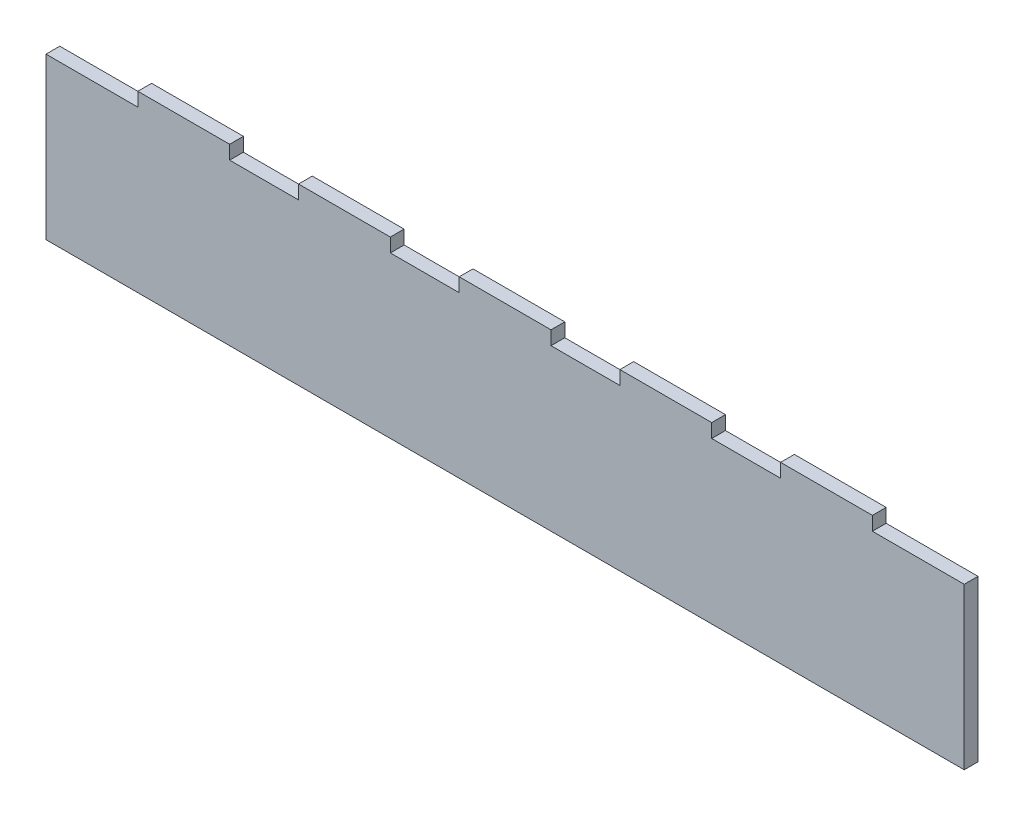
ISO-10303-21;
HEADER;
FILE_DESCRIPTION(('STEP AP214'),'2;1');
FILE_NAME('part.step','',(''),(''),'','','');
FILE_SCHEMA(('AUTOMOTIVE_DESIGN { 1 0 10303 214 1 1 1 1 }'));
ENDSEC;
DATA;
#1=APPLICATION_CONTEXT('core data for automotive mechanical design processes');
#2=APPLICATION_PROTOCOL_DEFINITION('international standard','automotive_design',2000,#1);
#3=PRODUCT_CONTEXT('',#1,'mechanical');
#4=PRODUCT('Part','Part','',(#3));
#5=PRODUCT_RELATED_PRODUCT_CATEGORY('part','',(#4));
#6=PRODUCT_DEFINITION_FORMATION('','',#4);
#7=PRODUCT_DEFINITION_CONTEXT('part definition',#1,'design');
#8=PRODUCT_DEFINITION('design','',#6,#7);
#9=PRODUCT_DEFINITION_SHAPE('','',#8);
#10=(LENGTH_UNIT() NAMED_UNIT(*) SI_UNIT(.MILLI.,.METRE.));
#11=(NAMED_UNIT(*) PLANE_ANGLE_UNIT() SI_UNIT($,.RADIAN.));
#12=(NAMED_UNIT(*) SI_UNIT($,.STERADIAN.) SOLID_ANGLE_UNIT());
#13=UNCERTAINTY_MEASURE_WITH_UNIT(LENGTH_MEASURE(1.E-05),#10,'distance_accuracy_value','');
#14=(GEOMETRIC_REPRESENTATION_CONTEXT(3) GLOBAL_UNCERTAINTY_ASSIGNED_CONTEXT((#13)) GLOBAL_UNIT_ASSIGNED_CONTEXT((#10,
#11,#12)) REPRESENTATION_CONTEXT('',''));
#15=CARTESIAN_POINT('',(0.,0.,0.));
#16=DIRECTION('',(0.,0.,1.));
#17=DIRECTION('',(1.,0.,0.));
#18=AXIS2_PLACEMENT_3D('',#15,#16,#17);
#19=CARTESIAN_POINT('',(0.,0.,-3.));
#20=DIRECTION('',(-1.,0.,0.));
#21=DIRECTION('',(0.,0.,1.));
#22=AXIS2_PLACEMENT_3D('',#19,#20,#21);
#23=PLANE('',#22);
#24=DIRECTION('',(0.,-1.,0.));
#25=VECTOR('',#24,1.);
#26=CARTESIAN_POINT('',(0.,0.,0.));
#27=LINE('',#26,#25);
#28=CARTESIAN_POINT('',(0.,0.,0.));
#29=VERTEX_POINT('',#28);
#30=CARTESIAN_POINT('',(0.,-35.,0.));
#31=VERTEX_POINT('',#30);
#32=EDGE_CURVE('E230',#29,#31,#27,.T.);
#33=ORIENTED_EDGE('',*,*,#32,.F.);
#34=DIRECTION('',(0.,0.,1.));
#35=VECTOR('',#34,1.);
#36=CARTESIAN_POINT('',(0.,0.,-3.));
#37=LINE('',#36,#35);
#38=CARTESIAN_POINT('',(0.,0.,-3.));
#39=VERTEX_POINT('',#38);
#40=EDGE_CURVE('E11',#39,#29,#37,.T.);
#41=ORIENTED_EDGE('',*,*,#40,.F.);
#42=DIRECTION('',(0.,-1.,0.));
#43=VECTOR('',#42,1.);
#44=CARTESIAN_POINT('',(0.,0.,-3.));
#45=LINE('',#44,#43);
#46=CARTESIAN_POINT('',(0.,-35.,-3.));
#47=VERTEX_POINT('',#46);
#48=EDGE_CURVE('E287',#39,#47,#45,.T.);
#49=ORIENTED_EDGE('',*,*,#48,.T.);
#50=DIRECTION('',(0.,0.,1.));
#51=VECTOR('',#50,1.);
#52=CARTESIAN_POINT('',(0.,-35.,-3.));
#53=LINE('',#52,#51);
#54=EDGE_CURVE('E38',#47,#31,#53,.T.);
#55=ORIENTED_EDGE('',*,*,#54,.T.);
#56=EDGE_LOOP('',(#33,#41,#49,#55));
#57=FACE_BOUND('',#56,.T.);
#58=ADVANCED_FACE('F35',(#57),#23,.T.);
#59=CARTESIAN_POINT('',(0.,0.,-3.));
#60=DIRECTION('',(0.,-1.,0.));
#61=DIRECTION('',(0.,0.,-1.));
#62=AXIS2_PLACEMENT_3D('',#59,#60,#61);
#63=PLANE('',#62);
#64=DIRECTION('',(1.,0.,0.));
#65=VECTOR('',#64,1.);
#66=CARTESIAN_POINT('',(0.,0.,0.));
#67=LINE('',#66,#65);
#68=CARTESIAN_POINT('',(20.,0.,0.));
#69=VERTEX_POINT('',#68);
#70=EDGE_CURVE('E128',#29,#69,#67,.T.);
#71=ORIENTED_EDGE('',*,*,#70,.T.);
#72=DIRECTION('',(0.,0.,1.));
#73=VECTOR('',#72,1.);
#74=CARTESIAN_POINT('',(20.,0.,-3.));
#75=LINE('',#74,#73);
#76=CARTESIAN_POINT('',(20.,0.,-3.));
#77=VERTEX_POINT('',#76);
#78=EDGE_CURVE('E44',#77,#69,#75,.T.);
#79=ORIENTED_EDGE('',*,*,#78,.F.);
#80=DIRECTION('',(1.,0.,0.));
#81=VECTOR('',#80,1.);
#82=CARTESIAN_POINT('',(0.,0.,-3.));
#83=LINE('',#82,#81);
#84=EDGE_CURVE('E208',#39,#77,#83,.T.);
#85=ORIENTED_EDGE('',*,*,#84,.F.);
#86=ORIENTED_EDGE('',*,*,#40,.T.);
#87=EDGE_LOOP('',(#71,#79,#85,#86));
#88=FACE_BOUND('',#87,.T.);
#89=ADVANCED_FACE('F477',(#88),#63,.F.);
#90=CARTESIAN_POINT('',(20.,0.,-3.));
#91=DIRECTION('',(1.,0.,0.));
#92=DIRECTION('',(0.,0.,-1.));
#93=AXIS2_PLACEMENT_3D('',#90,#91,#92);
#94=PLANE('',#93);
#95=DIRECTION('',(0.,1.,0.));
#96=VECTOR('',#95,1.);
#97=CARTESIAN_POINT('',(20.,0.,0.));
#98=LINE('',#97,#96);
#99=CARTESIAN_POINT('',(20.,3.,0.));
#100=VERTEX_POINT('',#99);
#101=EDGE_CURVE('E215',#69,#100,#98,.T.);
#102=ORIENTED_EDGE('',*,*,#101,.T.);
#103=DIRECTION('',(0.,0.,1.));
#104=VECTOR('',#103,1.);
#105=CARTESIAN_POINT('',(20.,3.,-3.));
#106=LINE('',#105,#104);
#107=CARTESIAN_POINT('',(20.,3.,-3.));
#108=VERTEX_POINT('',#107);
#109=EDGE_CURVE('E212',#108,#100,#106,.T.);
#110=ORIENTED_EDGE('',*,*,#109,.F.);
#111=DIRECTION('',(0.,1.,0.));
#112=VECTOR('',#111,1.);
#113=CARTESIAN_POINT('',(20.,0.,-3.));
#114=LINE('',#113,#112);
#115=EDGE_CURVE('E200',#77,#108,#114,.T.);
#116=ORIENTED_EDGE('',*,*,#115,.F.);
#117=ORIENTED_EDGE('',*,*,#78,.T.);
#118=EDGE_LOOP('',(#102,#110,#116,#117));
#119=FACE_BOUND('',#118,.T.);
#120=ADVANCED_FACE('F213',(#119),#94,.F.);
#121=CARTESIAN_POINT('',(20.,3.,-3.));
#122=DIRECTION('',(0.,-1.,0.));
#123=DIRECTION('',(0.,0.,-1.));
#124=AXIS2_PLACEMENT_3D('',#121,#122,#123);
#125=PLANE('',#124);
#126=DIRECTION('',(1.,0.,0.));
#127=VECTOR('',#126,1.);
#128=CARTESIAN_POINT('',(20.,3.,0.));
#129=LINE('',#128,#127);
#130=CARTESIAN_POINT('',(40.,3.,0.));
#131=VERTEX_POINT('',#130);
#132=EDGE_CURVE('E284',#100,#131,#129,.T.);
#133=ORIENTED_EDGE('',*,*,#132,.T.);
#134=DIRECTION('',(0.,0.,1.));
#135=VECTOR('',#134,1.);
#136=CARTESIAN_POINT('',(40.,3.,-3.));
#137=LINE('',#136,#135);
#138=CARTESIAN_POINT('',(40.,3.,-3.));
#139=VERTEX_POINT('',#138);
#140=EDGE_CURVE('E219',#139,#131,#137,.T.);
#141=ORIENTED_EDGE('',*,*,#140,.F.);
#142=DIRECTION('',(1.,0.,0.));
#143=VECTOR('',#142,1.);
#144=CARTESIAN_POINT('',(20.,3.,-3.));
#145=LINE('',#144,#143);
#146=EDGE_CURVE('E206',#108,#139,#145,.T.);
#147=ORIENTED_EDGE('',*,*,#146,.F.);
#148=ORIENTED_EDGE('',*,*,#109,.T.);
#149=EDGE_LOOP('',(#133,#141,#147,#148));
#150=FACE_BOUND('',#149,.T.);
#151=ADVANCED_FACE('F221',(#150),#125,.F.);
#152=CARTESIAN_POINT('',(40.,0.,-3.));
#153=DIRECTION('',(1.,0.,0.));
#154=DIRECTION('',(0.,0.,-1.));
#155=AXIS2_PLACEMENT_3D('',#152,#153,#154);
#156=PLANE('',#155);
#157=DIRECTION('',(0.,1.,0.));
#158=VECTOR('',#157,1.);
#159=CARTESIAN_POINT('',(40.,0.,0.));
#160=LINE('',#159,#158);
#161=CARTESIAN_POINT('',(40.,0.,0.));
#162=VERTEX_POINT('',#161);
#163=EDGE_CURVE('E281',#162,#131,#160,.T.);
#164=ORIENTED_EDGE('',*,*,#163,.F.);
#165=DIRECTION('',(0.,0.,1.));
#166=VECTOR('',#165,1.);
#167=CARTESIAN_POINT('',(40.,0.,-3.));
#168=LINE('',#167,#166);
#169=CARTESIAN_POINT('',(40.,0.,-3.));
#170=VERTEX_POINT('',#169);
#171=EDGE_CURVE('E291',#170,#162,#168,.T.);
#172=ORIENTED_EDGE('',*,*,#171,.F.);
#173=DIRECTION('',(0.,1.,0.));
#174=VECTOR('',#173,1.);
#175=CARTESIAN_POINT('',(40.,0.,-3.));
#176=LINE('',#175,#174);
#177=EDGE_CURVE('E223',#170,#139,#176,.T.);
#178=ORIENTED_EDGE('',*,*,#177,.T.);
#179=ORIENTED_EDGE('',*,*,#140,.T.);
#180=EDGE_LOOP('',(#164,#172,#178,#179));
#181=FACE_BOUND('',#180,.T.);
#182=ADVANCED_FACE('F345',(#181),#156,.T.);
#183=CARTESIAN_POINT('',(40.,0.,-3.));
#184=DIRECTION('',(0.,-1.,0.));
#185=DIRECTION('',(0.,0.,-1.));
#186=AXIS2_PLACEMENT_3D('',#183,#184,#185);
#187=PLANE('',#186);
#188=DIRECTION('',(1.,0.,0.));
#189=VECTOR('',#188,1.);
#190=CARTESIAN_POINT('',(40.,0.,0.));
#191=LINE('',#190,#189);
#192=CARTESIAN_POINT('',(55.,0.,0.));
#193=VERTEX_POINT('',#192);
#194=EDGE_CURVE('E279',#162,#193,#191,.T.);
#195=ORIENTED_EDGE('',*,*,#194,.T.);
#196=DIRECTION('',(0.,0.,1.));
#197=VECTOR('',#196,1.);
#198=CARTESIAN_POINT('',(55.,0.,-3.));
#199=LINE('',#198,#197);
#200=CARTESIAN_POINT('',(55.,0.,-3.));
#201=VERTEX_POINT('',#200);
#202=EDGE_CURVE('E293',#201,#193,#199,.T.);
#203=ORIENTED_EDGE('',*,*,#202,.F.);
#204=DIRECTION('',(1.,0.,0.));
#205=VECTOR('',#204,1.);
#206=CARTESIAN_POINT('',(40.,0.,-3.));
#207=LINE('',#206,#205);
#208=EDGE_CURVE('E225',#170,#201,#207,.T.);
#209=ORIENTED_EDGE('',*,*,#208,.F.);
#210=ORIENTED_EDGE('',*,*,#171,.T.);
#211=EDGE_LOOP('',(#195,#203,#209,#210));
#212=FACE_BOUND('',#211,.T.);
#213=ADVANCED_FACE('F352',(#212),#187,.F.);
#214=CARTESIAN_POINT('',(55.,0.,-3.));
#215=DIRECTION('',(1.,0.,0.));
#216=DIRECTION('',(0.,0.,-1.));
#217=AXIS2_PLACEMENT_3D('',#214,#215,#216);
#218=PLANE('',#217);
#219=DIRECTION('',(0.,1.,0.));
#220=VECTOR('',#219,1.);
#221=CARTESIAN_POINT('',(55.,0.,0.));
#222=LINE('',#221,#220);
#223=CARTESIAN_POINT('',(55.,3.,0.));
#224=VERTEX_POINT('',#223);
#225=EDGE_CURVE('E277',#193,#224,#222,.T.);
#226=ORIENTED_EDGE('',*,*,#225,.T.);
#227=DIRECTION('',(0.,0.,1.));
#228=VECTOR('',#227,1.);
#229=CARTESIAN_POINT('',(55.,3.,-3.));
#230=LINE('',#229,#228);
#231=CARTESIAN_POINT('',(55.,3.,-3.));
#232=VERTEX_POINT('',#231);
#233=EDGE_CURVE('E296',#232,#224,#230,.T.);
#234=ORIENTED_EDGE('',*,*,#233,.F.);
#235=DIRECTION('',(0.,1.,0.));
#236=VECTOR('',#235,1.);
#237=CARTESIAN_POINT('',(55.,0.,-3.));
#238=LINE('',#237,#236);
#239=EDGE_CURVE('E349',#201,#232,#238,.T.);
#240=ORIENTED_EDGE('',*,*,#239,.F.);
#241=ORIENTED_EDGE('',*,*,#202,.T.);
#242=EDGE_LOOP('',(#226,#234,#240,#241));
#243=FACE_BOUND('',#242,.T.);
#244=ADVANCED_FACE('F354',(#243),#218,.F.);
#245=CARTESIAN_POINT('',(55.,3.,-3.));
#246=DIRECTION('',(0.,-1.,0.));
#247=DIRECTION('',(0.,0.,-1.));
#248=AXIS2_PLACEMENT_3D('',#245,#246,#247);
#249=PLANE('',#248);
#250=DIRECTION('',(1.,0.,0.));
#251=VECTOR('',#250,1.);
#252=CARTESIAN_POINT('',(55.,3.,0.));
#253=LINE('',#252,#251);
#254=CARTESIAN_POINT('',(75.,3.,0.));
#255=VERTEX_POINT('',#254);
#256=EDGE_CURVE('E274',#224,#255,#253,.T.);
#257=ORIENTED_EDGE('',*,*,#256,.T.);
#258=DIRECTION('',(0.,0.,1.));
#259=VECTOR('',#258,1.);
#260=CARTESIAN_POINT('',(75.,3.,-3.));
#261=LINE('',#260,#259);
#262=CARTESIAN_POINT('',(75.,3.,-3.));
#263=VERTEX_POINT('',#262);
#264=EDGE_CURVE('E299',#263,#255,#261,.T.);
#265=ORIENTED_EDGE('',*,*,#264,.F.);
#266=DIRECTION('',(1.,0.,0.));
#267=VECTOR('',#266,1.);
#268=CARTESIAN_POINT('',(55.,3.,-3.));
#269=LINE('',#268,#267);
#270=EDGE_CURVE('E356',#232,#263,#269,.T.);
#271=ORIENTED_EDGE('',*,*,#270,.F.);
#272=ORIENTED_EDGE('',*,*,#233,.T.);
#273=EDGE_LOOP('',(#257,#265,#271,#272));
#274=FACE_BOUND('',#273,.T.);
#275=ADVANCED_FACE('F467',(#274),#249,.F.);
#276=CARTESIAN_POINT('',(75.,0.,-3.));
#277=DIRECTION('',(1.,0.,0.));
#278=DIRECTION('',(0.,0.,-1.));
#279=AXIS2_PLACEMENT_3D('',#276,#277,#278);
#280=PLANE('',#279);
#281=DIRECTION('',(0.,1.,0.));
#282=VECTOR('',#281,1.);
#283=CARTESIAN_POINT('',(75.,0.,0.));
#284=LINE('',#283,#282);
#285=CARTESIAN_POINT('',(75.,0.,0.));
#286=VERTEX_POINT('',#285);
#287=EDGE_CURVE('E271',#286,#255,#284,.T.);
#288=ORIENTED_EDGE('',*,*,#287,.F.);
#289=DIRECTION('',(0.,0.,1.));
#290=VECTOR('',#289,1.);
#291=CARTESIAN_POINT('',(75.,0.,-3.));
#292=LINE('',#291,#290);
#293=CARTESIAN_POINT('',(75.,0.,-3.));
#294=VERTEX_POINT('',#293);
#295=EDGE_CURVE('E301',#294,#286,#292,.T.);
#296=ORIENTED_EDGE('',*,*,#295,.F.);
#297=DIRECTION('',(0.,1.,0.));
#298=VECTOR('',#297,1.);
#299=CARTESIAN_POINT('',(75.,0.,-3.));
#300=LINE('',#299,#298);
#301=EDGE_CURVE('E358',#294,#263,#300,.T.);
#302=ORIENTED_EDGE('',*,*,#301,.T.);
#303=ORIENTED_EDGE('',*,*,#264,.T.);
#304=EDGE_LOOP('',(#288,#296,#302,#303));
#305=FACE_BOUND('',#304,.T.);
#306=ADVANCED_FACE('F463',(#305),#280,.T.);
#307=CARTESIAN_POINT('',(75.,0.,-3.));
#308=DIRECTION('',(0.,-1.,0.));
#309=DIRECTION('',(0.,0.,-1.));
#310=AXIS2_PLACEMENT_3D('',#307,#308,#309);
#311=PLANE('',#310);
#312=DIRECTION('',(1.,0.,0.));
#313=VECTOR('',#312,1.);
#314=CARTESIAN_POINT('',(75.,0.,0.));
#315=LINE('',#314,#313);
#316=CARTESIAN_POINT('',(90.,0.,0.));
#317=VERTEX_POINT('',#316);
#318=EDGE_CURVE('E269',#286,#317,#315,.T.);
#319=ORIENTED_EDGE('',*,*,#318,.T.);
#320=DIRECTION('',(0.,0.,1.));
#321=VECTOR('',#320,1.);
#322=CARTESIAN_POINT('',(90.,0.,-3.));
#323=LINE('',#322,#321);
#324=CARTESIAN_POINT('',(90.,0.,-3.));
#325=VERTEX_POINT('',#324);
#326=EDGE_CURVE('E303',#325,#317,#323,.T.);
#327=ORIENTED_EDGE('',*,*,#326,.F.);
#328=DIRECTION('',(1.,0.,0.));
#329=VECTOR('',#328,1.);
#330=CARTESIAN_POINT('',(75.,0.,-3.));
#331=LINE('',#330,#329);
#332=EDGE_CURVE('E363',#294,#325,#331,.T.);
#333=ORIENTED_EDGE('',*,*,#332,.F.);
#334=ORIENTED_EDGE('',*,*,#295,.T.);
#335=EDGE_LOOP('',(#319,#327,#333,#334));
#336=FACE_BOUND('',#335,.T.);
#337=ADVANCED_FACE('F460',(#336),#311,.F.);
#338=CARTESIAN_POINT('',(90.,0.,-3.));
#339=DIRECTION('',(1.,0.,0.));
#340=DIRECTION('',(0.,0.,-1.));
#341=AXIS2_PLACEMENT_3D('',#338,#339,#340);
#342=PLANE('',#341);
#343=DIRECTION('',(0.,1.,0.));
#344=VECTOR('',#343,1.);
#345=CARTESIAN_POINT('',(90.,0.,0.));
#346=LINE('',#345,#344);
#347=CARTESIAN_POINT('',(90.,3.,0.));
#348=VERTEX_POINT('',#347);
#349=EDGE_CURVE('E267',#317,#348,#346,.T.);
#350=ORIENTED_EDGE('',*,*,#349,.T.);
#351=DIRECTION('',(0.,0.,1.));
#352=VECTOR('',#351,1.);
#353=CARTESIAN_POINT('',(90.,3.,-3.));
#354=LINE('',#353,#352);
#355=CARTESIAN_POINT('',(90.,3.,-3.));
#356=VERTEX_POINT('',#355);
#357=EDGE_CURVE('E306',#356,#348,#354,.T.);
#358=ORIENTED_EDGE('',*,*,#357,.F.);
#359=DIRECTION('',(0.,1.,0.));
#360=VECTOR('',#359,1.);
#361=CARTESIAN_POINT('',(90.,0.,-3.));
#362=LINE('',#361,#360);
#363=EDGE_CURVE('E365',#325,#356,#362,.T.);
#364=ORIENTED_EDGE('',*,*,#363,.F.);
#365=ORIENTED_EDGE('',*,*,#326,.T.);
#366=EDGE_LOOP('',(#350,#358,#364,#365));
#367=FACE_BOUND('',#366,.T.);
#368=ADVANCED_FACE('F455',(#367),#342,.F.);
#369=CARTESIAN_POINT('',(90.,3.,-3.));
#370=DIRECTION('',(0.,-1.,0.));
#371=DIRECTION('',(0.,0.,-1.));
#372=AXIS2_PLACEMENT_3D('',#369,#370,#371);
#373=PLANE('',#372);
#374=DIRECTION('',(1.,0.,0.));
#375=VECTOR('',#374,1.);
#376=CARTESIAN_POINT('',(90.,3.,0.));
#377=LINE('',#376,#375);
#378=CARTESIAN_POINT('',(110.,3.,0.));
#379=VERTEX_POINT('',#378);
#380=EDGE_CURVE('E264',#348,#379,#377,.T.);
#381=ORIENTED_EDGE('',*,*,#380,.T.);
#382=DIRECTION('',(0.,0.,1.));
#383=VECTOR('',#382,1.);
#384=CARTESIAN_POINT('',(110.,3.,-3.));
#385=LINE('',#384,#383);
#386=CARTESIAN_POINT('',(110.,3.,-3.));
#387=VERTEX_POINT('',#386);
#388=EDGE_CURVE('E309',#387,#379,#385,.T.);
#389=ORIENTED_EDGE('',*,*,#388,.F.);
#390=DIRECTION('',(1.,0.,0.));
#391=VECTOR('',#390,1.);
#392=CARTESIAN_POINT('',(90.,3.,-3.));
#393=LINE('',#392,#391);
#394=EDGE_CURVE('E367',#356,#387,#393,.T.);
#395=ORIENTED_EDGE('',*,*,#394,.F.);
#396=ORIENTED_EDGE('',*,*,#357,.T.);
#397=EDGE_LOOP('',(#381,#389,#395,#396));
#398=FACE_BOUND('',#397,.T.);
#399=ADVANCED_FACE('F449',(#398),#373,.F.);
#400=CARTESIAN_POINT('',(110.,0.,-3.));
#401=DIRECTION('',(1.,0.,0.));
#402=DIRECTION('',(0.,0.,-1.));
#403=AXIS2_PLACEMENT_3D('',#400,#401,#402);
#404=PLANE('',#403);
#405=DIRECTION('',(0.,1.,0.));
#406=VECTOR('',#405,1.);
#407=CARTESIAN_POINT('',(110.,0.,0.));
#408=LINE('',#407,#406);
#409=CARTESIAN_POINT('',(110.,0.,0.));
#410=VERTEX_POINT('',#409);
#411=EDGE_CURVE('E261',#410,#379,#408,.T.);
#412=ORIENTED_EDGE('',*,*,#411,.F.);
#413=DIRECTION('',(0.,0.,1.));
#414=VECTOR('',#413,1.);
#415=CARTESIAN_POINT('',(110.,0.,-3.));
#416=LINE('',#415,#414);
#417=CARTESIAN_POINT('',(110.,0.,-3.));
#418=VERTEX_POINT('',#417);
#419=EDGE_CURVE('E311',#418,#410,#416,.T.);
#420=ORIENTED_EDGE('',*,*,#419,.F.);
#421=DIRECTION('',(0.,1.,0.));
#422=VECTOR('',#421,1.);
#423=CARTESIAN_POINT('',(110.,0.,-3.));
#424=LINE('',#423,#422);
#425=EDGE_CURVE('E369',#418,#387,#424,.T.);
#426=ORIENTED_EDGE('',*,*,#425,.T.);
#427=ORIENTED_EDGE('',*,*,#388,.T.);
#428=EDGE_LOOP('',(#412,#420,#426,#427));
#429=FACE_BOUND('',#428,.T.);
#430=ADVANCED_FACE('F445',(#429),#404,.T.);
#431=CARTESIAN_POINT('',(110.,0.,-3.));
#432=DIRECTION('',(0.,-1.,0.));
#433=DIRECTION('',(0.,0.,-1.));
#434=AXIS2_PLACEMENT_3D('',#431,#432,#433);
#435=PLANE('',#434);
#436=DIRECTION('',(1.,0.,0.));
#437=VECTOR('',#436,1.);
#438=CARTESIAN_POINT('',(110.,0.,0.));
#439=LINE('',#438,#437);
#440=CARTESIAN_POINT('',(125.,0.,0.));
#441=VERTEX_POINT('',#440);
#442=EDGE_CURVE('E259',#410,#441,#439,.T.);
#443=ORIENTED_EDGE('',*,*,#442,.T.);
#444=DIRECTION('',(0.,0.,1.));
#445=VECTOR('',#444,1.);
#446=CARTESIAN_POINT('',(125.,0.,-3.));
#447=LINE('',#446,#445);
#448=CARTESIAN_POINT('',(125.,0.,-3.));
#449=VERTEX_POINT('',#448);
#450=EDGE_CURVE('E313',#449,#441,#447,.T.);
#451=ORIENTED_EDGE('',*,*,#450,.F.);
#452=DIRECTION('',(1.,0.,0.));
#453=VECTOR('',#452,1.);
#454=CARTESIAN_POINT('',(110.,0.,-3.));
#455=LINE('',#454,#453);
#456=EDGE_CURVE('E372',#418,#449,#455,.T.);
#457=ORIENTED_EDGE('',*,*,#456,.F.);
#458=ORIENTED_EDGE('',*,*,#419,.T.);
#459=EDGE_LOOP('',(#443,#451,#457,#458));
#460=FACE_BOUND('',#459,.T.);
#461=ADVANCED_FACE('F440',(#460),#435,.F.);
#462=CARTESIAN_POINT('',(125.,0.,-3.));
#463=DIRECTION('',(1.,0.,0.));
#464=DIRECTION('',(0.,0.,-1.));
#465=AXIS2_PLACEMENT_3D('',#462,#463,#464);
#466=PLANE('',#465);
#467=DIRECTION('',(0.,1.,0.));
#468=VECTOR('',#467,1.);
#469=CARTESIAN_POINT('',(125.,0.,0.));
#470=LINE('',#469,#468);
#471=CARTESIAN_POINT('',(125.,3.,0.));
#472=VERTEX_POINT('',#471);
#473=EDGE_CURVE('E257',#441,#472,#470,.T.);
#474=ORIENTED_EDGE('',*,*,#473,.T.);
#475=DIRECTION('',(0.,0.,1.));
#476=VECTOR('',#475,1.);
#477=CARTESIAN_POINT('',(125.,3.,-3.));
#478=LINE('',#477,#476);
#479=CARTESIAN_POINT('',(125.,3.,-3.));
#480=VERTEX_POINT('',#479);
#481=EDGE_CURVE('E316',#480,#472,#478,.T.);
#482=ORIENTED_EDGE('',*,*,#481,.F.);
#483=DIRECTION('',(0.,1.,0.));
#484=VECTOR('',#483,1.);
#485=CARTESIAN_POINT('',(125.,0.,-3.));
#486=LINE('',#485,#484);
#487=EDGE_CURVE('E374',#449,#480,#486,.T.);
#488=ORIENTED_EDGE('',*,*,#487,.F.);
#489=ORIENTED_EDGE('',*,*,#450,.T.);
#490=EDGE_LOOP('',(#474,#482,#488,#489));
#491=FACE_BOUND('',#490,.T.);
#492=ADVANCED_FACE('F436',(#491),#466,.F.);
#493=CARTESIAN_POINT('',(125.,3.,-3.));
#494=DIRECTION('',(0.,-1.,0.));
#495=DIRECTION('',(0.,0.,-1.));
#496=AXIS2_PLACEMENT_3D('',#493,#494,#495);
#497=PLANE('',#496);
#498=DIRECTION('',(1.,0.,0.));
#499=VECTOR('',#498,1.);
#500=CARTESIAN_POINT('',(125.,3.,0.));
#501=LINE('',#500,#499);
#502=CARTESIAN_POINT('',(145.,3.,0.));
#503=VERTEX_POINT('',#502);
#504=EDGE_CURVE('E254',#472,#503,#501,.T.);
#505=ORIENTED_EDGE('',*,*,#504,.T.);
#506=DIRECTION('',(0.,0.,1.));
#507=VECTOR('',#506,1.);
#508=CARTESIAN_POINT('',(145.,3.,-3.));
#509=LINE('',#508,#507);
#510=CARTESIAN_POINT('',(145.,3.,-3.));
#511=VERTEX_POINT('',#510);
#512=EDGE_CURVE('E319',#511,#503,#509,.T.);
#513=ORIENTED_EDGE('',*,*,#512,.F.);
#514=DIRECTION('',(1.,0.,0.));
#515=VECTOR('',#514,1.);
#516=CARTESIAN_POINT('',(125.,3.,-3.));
#517=LINE('',#516,#515);
#518=EDGE_CURVE('E376',#480,#511,#517,.T.);
#519=ORIENTED_EDGE('',*,*,#518,.F.);
#520=ORIENTED_EDGE('',*,*,#481,.T.);
#521=EDGE_LOOP('',(#505,#513,#519,#520));
#522=FACE_BOUND('',#521,.T.);
#523=ADVANCED_FACE('F431',(#522),#497,.F.);
#524=CARTESIAN_POINT('',(145.,0.,-3.));
#525=DIRECTION('',(1.,0.,0.));
#526=DIRECTION('',(0.,0.,-1.));
#527=AXIS2_PLACEMENT_3D('',#524,#525,#526);
#528=PLANE('',#527);
#529=DIRECTION('',(0.,1.,0.));
#530=VECTOR('',#529,1.);
#531=CARTESIAN_POINT('',(145.,0.,0.));
#532=LINE('',#531,#530);
#533=CARTESIAN_POINT('',(145.,0.,0.));
#534=VERTEX_POINT('',#533);
#535=EDGE_CURVE('E251',#534,#503,#532,.T.);
#536=ORIENTED_EDGE('',*,*,#535,.F.);
#537=DIRECTION('',(0.,0.,1.));
#538=VECTOR('',#537,1.);
#539=CARTESIAN_POINT('',(145.,0.,-3.));
#540=LINE('',#539,#538);
#541=CARTESIAN_POINT('',(145.,0.,-3.));
#542=VERTEX_POINT('',#541);
#543=EDGE_CURVE('E321',#542,#534,#540,.T.);
#544=ORIENTED_EDGE('',*,*,#543,.F.);
#545=DIRECTION('',(0.,1.,0.));
#546=VECTOR('',#545,1.);
#547=CARTESIAN_POINT('',(145.,0.,-3.));
#548=LINE('',#547,#546);
#549=EDGE_CURVE('E378',#542,#511,#548,.T.);
#550=ORIENTED_EDGE('',*,*,#549,.T.);
#551=ORIENTED_EDGE('',*,*,#512,.T.);
#552=EDGE_LOOP('',(#536,#544,#550,#551));
#553=FACE_BOUND('',#552,.T.);
#554=ADVANCED_FACE('F425',(#553),#528,.T.);
#555=CARTESIAN_POINT('',(145.,0.,-3.));
#556=DIRECTION('',(0.,-1.,0.));
#557=DIRECTION('',(0.,0.,-1.));
#558=AXIS2_PLACEMENT_3D('',#555,#556,#557);
#559=PLANE('',#558);
#560=DIRECTION('',(1.,0.,0.));
#561=VECTOR('',#560,1.);
#562=CARTESIAN_POINT('',(145.,0.,0.));
#563=LINE('',#562,#561);
#564=CARTESIAN_POINT('',(160.,0.,0.));
#565=VERTEX_POINT('',#564);
#566=EDGE_CURVE('E249',#534,#565,#563,.T.);
#567=ORIENTED_EDGE('',*,*,#566,.T.);
#568=DIRECTION('',(0.,0.,1.));
#569=VECTOR('',#568,1.);
#570=CARTESIAN_POINT('',(160.,0.,-3.));
#571=LINE('',#570,#569);
#572=CARTESIAN_POINT('',(160.,0.,-3.));
#573=VERTEX_POINT('',#572);
#574=EDGE_CURVE('E323',#573,#565,#571,.T.);
#575=ORIENTED_EDGE('',*,*,#574,.F.);
#576=DIRECTION('',(1.,0.,0.));
#577=VECTOR('',#576,1.);
#578=CARTESIAN_POINT('',(145.,0.,-3.));
#579=LINE('',#578,#577);
#580=EDGE_CURVE('E381',#542,#573,#579,.T.);
#581=ORIENTED_EDGE('',*,*,#580,.F.);
#582=ORIENTED_EDGE('',*,*,#543,.T.);
#583=EDGE_LOOP('',(#567,#575,#581,#582));
#584=FACE_BOUND('',#583,.T.);
#585=ADVANCED_FACE('F422',(#584),#559,.F.);
#586=CARTESIAN_POINT('',(160.,0.,-3.));
#587=DIRECTION('',(1.,0.,0.));
#588=DIRECTION('',(0.,0.,-1.));
#589=AXIS2_PLACEMENT_3D('',#586,#587,#588);
#590=PLANE('',#589);
#591=DIRECTION('',(0.,1.,0.));
#592=VECTOR('',#591,1.);
#593=CARTESIAN_POINT('',(160.,0.,0.));
#594=LINE('',#593,#592);
#595=CARTESIAN_POINT('',(160.,3.,0.));
#596=VERTEX_POINT('',#595);
#597=EDGE_CURVE('E247',#565,#596,#594,.T.);
#598=ORIENTED_EDGE('',*,*,#597,.T.);
#599=DIRECTION('',(0.,0.,1.));
#600=VECTOR('',#599,1.);
#601=CARTESIAN_POINT('',(160.,3.,-3.));
#602=LINE('',#601,#600);
#603=CARTESIAN_POINT('',(160.,3.,-3.));
#604=VERTEX_POINT('',#603);
#605=EDGE_CURVE('E326',#604,#596,#602,.T.);
#606=ORIENTED_EDGE('',*,*,#605,.F.);
#607=DIRECTION('',(0.,1.,0.));
#608=VECTOR('',#607,1.);
#609=CARTESIAN_POINT('',(160.,0.,-3.));
#610=LINE('',#609,#608);
#611=EDGE_CURVE('E383',#573,#604,#610,.T.);
#612=ORIENTED_EDGE('',*,*,#611,.F.);
#613=ORIENTED_EDGE('',*,*,#574,.T.);
#614=EDGE_LOOP('',(#598,#606,#612,#613));
#615=FACE_BOUND('',#614,.T.);
#616=ADVANCED_FACE('F417',(#615),#590,.F.);
#617=CARTESIAN_POINT('',(160.,3.,-3.));
#618=DIRECTION('',(0.,-1.,0.));
#619=DIRECTION('',(0.,0.,-1.));
#620=AXIS2_PLACEMENT_3D('',#617,#618,#619);
#621=PLANE('',#620);
#622=DIRECTION('',(1.,0.,0.));
#623=VECTOR('',#622,1.);
#624=CARTESIAN_POINT('',(160.,3.,0.));
#625=LINE('',#624,#623);
#626=CARTESIAN_POINT('',(180.,3.,0.));
#627=VERTEX_POINT('',#626);
#628=EDGE_CURVE('E244',#596,#627,#625,.T.);
#629=ORIENTED_EDGE('',*,*,#628,.T.);
#630=DIRECTION('',(0.,0.,1.));
#631=VECTOR('',#630,1.);
#632=CARTESIAN_POINT('',(180.,3.,-3.));
#633=LINE('',#632,#631);
#634=CARTESIAN_POINT('',(180.,3.,-3.));
#635=VERTEX_POINT('',#634);
#636=EDGE_CURVE('E329',#635,#627,#633,.T.);
#637=ORIENTED_EDGE('',*,*,#636,.F.);
#638=DIRECTION('',(1.,0.,0.));
#639=VECTOR('',#638,1.);
#640=CARTESIAN_POINT('',(160.,3.,-3.));
#641=LINE('',#640,#639);
#642=EDGE_CURVE('E385',#604,#635,#641,.T.);
#643=ORIENTED_EDGE('',*,*,#642,.F.);
#644=ORIENTED_EDGE('',*,*,#605,.T.);
#645=EDGE_LOOP('',(#629,#637,#643,#644));
#646=FACE_BOUND('',#645,.T.);
#647=ADVANCED_FACE('F411',(#646),#621,.F.);
#648=CARTESIAN_POINT('',(180.,0.,-3.));
#649=DIRECTION('',(1.,0.,0.));
#650=DIRECTION('',(0.,0.,-1.));
#651=AXIS2_PLACEMENT_3D('',#648,#649,#650);
#652=PLANE('',#651);
#653=DIRECTION('',(0.,1.,0.));
#654=VECTOR('',#653,1.);
#655=CARTESIAN_POINT('',(180.,0.,0.));
#656=LINE('',#655,#654);
#657=CARTESIAN_POINT('',(180.,0.,0.));
#658=VERTEX_POINT('',#657);
#659=EDGE_CURVE('E241',#658,#627,#656,.T.);
#660=ORIENTED_EDGE('',*,*,#659,.F.);
#661=DIRECTION('',(0.,0.,1.));
#662=VECTOR('',#661,1.);
#663=CARTESIAN_POINT('',(180.,0.,-3.));
#664=LINE('',#663,#662);
#665=CARTESIAN_POINT('',(180.,0.,-3.));
#666=VERTEX_POINT('',#665);
#667=EDGE_CURVE('E331',#666,#658,#664,.T.);
#668=ORIENTED_EDGE('',*,*,#667,.F.);
#669=DIRECTION('',(0.,1.,0.));
#670=VECTOR('',#669,1.);
#671=CARTESIAN_POINT('',(180.,0.,-3.));
#672=LINE('',#671,#670);
#673=EDGE_CURVE('E387',#666,#635,#672,.T.);
#674=ORIENTED_EDGE('',*,*,#673,.T.);
#675=ORIENTED_EDGE('',*,*,#636,.T.);
#676=EDGE_LOOP('',(#660,#668,#674,#675));
#677=FACE_BOUND('',#676,.T.);
#678=ADVANCED_FACE('F407',(#677),#652,.T.);
#679=CARTESIAN_POINT('',(180.,0.,-3.));
#680=DIRECTION('',(0.,-1.,0.));
#681=DIRECTION('',(0.,0.,-1.));
#682=AXIS2_PLACEMENT_3D('',#679,#680,#681);
#683=PLANE('',#682);
#684=DIRECTION('',(1.,0.,0.));
#685=VECTOR('',#684,1.);
#686=CARTESIAN_POINT('',(180.,0.,0.));
#687=LINE('',#686,#685);
#688=CARTESIAN_POINT('',(200.,0.,0.));
#689=VERTEX_POINT('',#688);
#690=EDGE_CURVE('E239',#658,#689,#687,.T.);
#691=ORIENTED_EDGE('',*,*,#690,.T.);
#692=DIRECTION('',(0.,0.,1.));
#693=VECTOR('',#692,1.);
#694=CARTESIAN_POINT('',(200.,0.,-3.));
#695=LINE('',#694,#693);
#696=CARTESIAN_POINT('',(200.,0.,-3.));
#697=VERTEX_POINT('',#696);
#698=EDGE_CURVE('E333',#697,#689,#695,.T.);
#699=ORIENTED_EDGE('',*,*,#698,.F.);
#700=DIRECTION('',(1.,0.,0.));
#701=VECTOR('',#700,1.);
#702=CARTESIAN_POINT('',(180.,0.,-3.));
#703=LINE('',#702,#701);
#704=EDGE_CURVE('E390',#666,#697,#703,.T.);
#705=ORIENTED_EDGE('',*,*,#704,.F.);
#706=ORIENTED_EDGE('',*,*,#667,.T.);
#707=EDGE_LOOP('',(#691,#699,#705,#706));
#708=FACE_BOUND('',#707,.T.);
#709=ADVANCED_FACE('F609',(#708),#683,.F.);
#710=CARTESIAN_POINT('',(200.,0.,-3.));
#711=DIRECTION('',(-1.,0.,0.));
#712=DIRECTION('',(0.,0.,1.));
#713=AXIS2_PLACEMENT_3D('',#710,#711,#712);
#714=PLANE('',#713);
#715=DIRECTION('',(0.,-1.,0.));
#716=VECTOR('',#715,1.);
#717=CARTESIAN_POINT('',(200.,0.,0.));
#718=LINE('',#717,#716);
#719=CARTESIAN_POINT('',(200.,-35.,0.));
#720=VERTEX_POINT('',#719);
#721=EDGE_CURVE('E236',#689,#720,#718,.T.);
#722=ORIENTED_EDGE('',*,*,#721,.T.);
#723=DIRECTION('',(0.,0.,1.));
#724=VECTOR('',#723,1.);
#725=CARTESIAN_POINT('',(200.,-35.,-3.));
#726=LINE('',#725,#724);
#727=CARTESIAN_POINT('',(200.,-35.,-3.));
#728=VERTEX_POINT('',#727);
#729=EDGE_CURVE('E335',#728,#720,#726,.T.);
#730=ORIENTED_EDGE('',*,*,#729,.F.);
#731=DIRECTION('',(0.,-1.,0.));
#732=VECTOR('',#731,1.);
#733=CARTESIAN_POINT('',(200.,0.,-3.));
#734=LINE('',#733,#732);
#735=EDGE_CURVE('E392',#697,#728,#734,.T.);
#736=ORIENTED_EDGE('',*,*,#735,.F.);
#737=ORIENTED_EDGE('',*,*,#698,.T.);
#738=EDGE_LOOP('',(#722,#730,#736,#737));
#739=FACE_BOUND('',#738,.T.);
#740=ADVANCED_FACE('F401',(#739),#714,.F.);
#741=CARTESIAN_POINT('',(0.,-35.,-3.));
#742=DIRECTION('',(0.,-1.,0.));
#743=DIRECTION('',(0.,0.,-1.));
#744=AXIS2_PLACEMENT_3D('',#741,#742,#743);
#745=PLANE('',#744);
#746=DIRECTION('',(1.,0.,0.));
#747=VECTOR('',#746,1.);
#748=CARTESIAN_POINT('',(0.,-35.,0.));
#749=LINE('',#748,#747);
#750=EDGE_CURVE('E233',#31,#720,#749,.T.);
#751=ORIENTED_EDGE('',*,*,#750,.F.);
#752=ORIENTED_EDGE('',*,*,#54,.F.);
#753=DIRECTION('',(1.,0.,0.));
#754=VECTOR('',#753,1.);
#755=CARTESIAN_POINT('',(0.,-35.,-3.));
#756=LINE('',#755,#754);
#757=EDGE_CURVE('E394',#47,#728,#756,.T.);
#758=ORIENTED_EDGE('',*,*,#757,.T.);
#759=ORIENTED_EDGE('',*,*,#729,.T.);
#760=EDGE_LOOP('',(#751,#752,#758,#759));
#761=FACE_BOUND('',#760,.T.);
#762=ADVANCED_FACE('F337',(#761),#745,.T.);
#763=CARTESIAN_POINT('',(0.,0.,-3.));
#764=DIRECTION('',(0.,0.,1.));
#765=DIRECTION('',(1.,0.,0.));
#766=AXIS2_PLACEMENT_3D('',#763,#764,#765);
#767=PLANE('',#766);
#768=ORIENTED_EDGE('',*,*,#48,.F.);
#769=ORIENTED_EDGE('',*,*,#84,.T.);
#770=ORIENTED_EDGE('',*,*,#115,.T.);
#771=ORIENTED_EDGE('',*,*,#146,.T.);
#772=ORIENTED_EDGE('',*,*,#177,.F.);
#773=ORIENTED_EDGE('',*,*,#208,.T.);
#774=ORIENTED_EDGE('',*,*,#239,.T.);
#775=ORIENTED_EDGE('',*,*,#270,.T.);
#776=ORIENTED_EDGE('',*,*,#301,.F.);
#777=ORIENTED_EDGE('',*,*,#332,.T.);
#778=ORIENTED_EDGE('',*,*,#363,.T.);
#779=ORIENTED_EDGE('',*,*,#394,.T.);
#780=ORIENTED_EDGE('',*,*,#425,.F.);
#781=ORIENTED_EDGE('',*,*,#456,.T.);
#782=ORIENTED_EDGE('',*,*,#487,.T.);
#783=ORIENTED_EDGE('',*,*,#518,.T.);
#784=ORIENTED_EDGE('',*,*,#549,.F.);
#785=ORIENTED_EDGE('',*,*,#580,.T.);
#786=ORIENTED_EDGE('',*,*,#611,.T.);
#787=ORIENTED_EDGE('',*,*,#642,.T.);
#788=ORIENTED_EDGE('',*,*,#673,.F.);
#789=ORIENTED_EDGE('',*,*,#704,.T.);
#790=ORIENTED_EDGE('',*,*,#735,.T.);
#791=ORIENTED_EDGE('',*,*,#757,.F.);
#792=EDGE_LOOP('',(#768,#769,#770,#771,#772,#773,#774,#775,#776,#777,#778,#779,#780,#781,#782,
#783,#784,#785,#786,#787,#788,#789,#790,#791));
#793=FACE_BOUND('',#792,.T.);
#794=ADVANCED_FACE('F203',(#793),#767,.F.);
#795=CARTESIAN_POINT('',(0.,0.,0.));
#796=DIRECTION('',(0.,0.,1.));
#797=DIRECTION('',(1.,0.,0.));
#798=AXIS2_PLACEMENT_3D('',#795,#796,#797);
#799=PLANE('',#798);
#800=ORIENTED_EDGE('',*,*,#32,.T.);
#801=ORIENTED_EDGE('',*,*,#750,.T.);
#802=ORIENTED_EDGE('',*,*,#721,.F.);
#803=ORIENTED_EDGE('',*,*,#690,.F.);
#804=ORIENTED_EDGE('',*,*,#659,.T.);
#805=ORIENTED_EDGE('',*,*,#628,.F.);
#806=ORIENTED_EDGE('',*,*,#597,.F.);
#807=ORIENTED_EDGE('',*,*,#566,.F.);
#808=ORIENTED_EDGE('',*,*,#535,.T.);
#809=ORIENTED_EDGE('',*,*,#504,.F.);
#810=ORIENTED_EDGE('',*,*,#473,.F.);
#811=ORIENTED_EDGE('',*,*,#442,.F.);
#812=ORIENTED_EDGE('',*,*,#411,.T.);
#813=ORIENTED_EDGE('',*,*,#380,.F.);
#814=ORIENTED_EDGE('',*,*,#349,.F.);
#815=ORIENTED_EDGE('',*,*,#318,.F.);
#816=ORIENTED_EDGE('',*,*,#287,.T.);
#817=ORIENTED_EDGE('',*,*,#256,.F.);
#818=ORIENTED_EDGE('',*,*,#225,.F.);
#819=ORIENTED_EDGE('',*,*,#194,.F.);
#820=ORIENTED_EDGE('',*,*,#163,.T.);
#821=ORIENTED_EDGE('',*,*,#132,.F.);
#822=ORIENTED_EDGE('',*,*,#101,.F.);
#823=ORIENTED_EDGE('',*,*,#70,.F.);
#824=EDGE_LOOP('',(#800,#801,#802,#803,#804,#805,#806,#807,#808,#809,#810,#811,#812,#813,#814,
#815,#816,#817,#818,#819,#820,#821,#822,#823));
#825=FACE_BOUND('',#824,.T.);
#826=ADVANCED_FACE('F340',(#825),#799,.T.);
#827=CLOSED_SHELL('',(#58,#89,#120,#151,#182,#213,#244,#275,#306,#337,#368,#399,#430,#461,#492,
#523,#554,#585,#616,#647,#678,#709,#740,#762,#794,#826));
#828=MANIFOLD_SOLID_BREP('B2',#827);
#829=ADVANCED_BREP_SHAPE_REPRESENTATION('',(#18,#828),#14);
#830=SHAPE_DEFINITION_REPRESENTATION(#9,#829);
ENDSEC;
END-ISO-10303-21;
